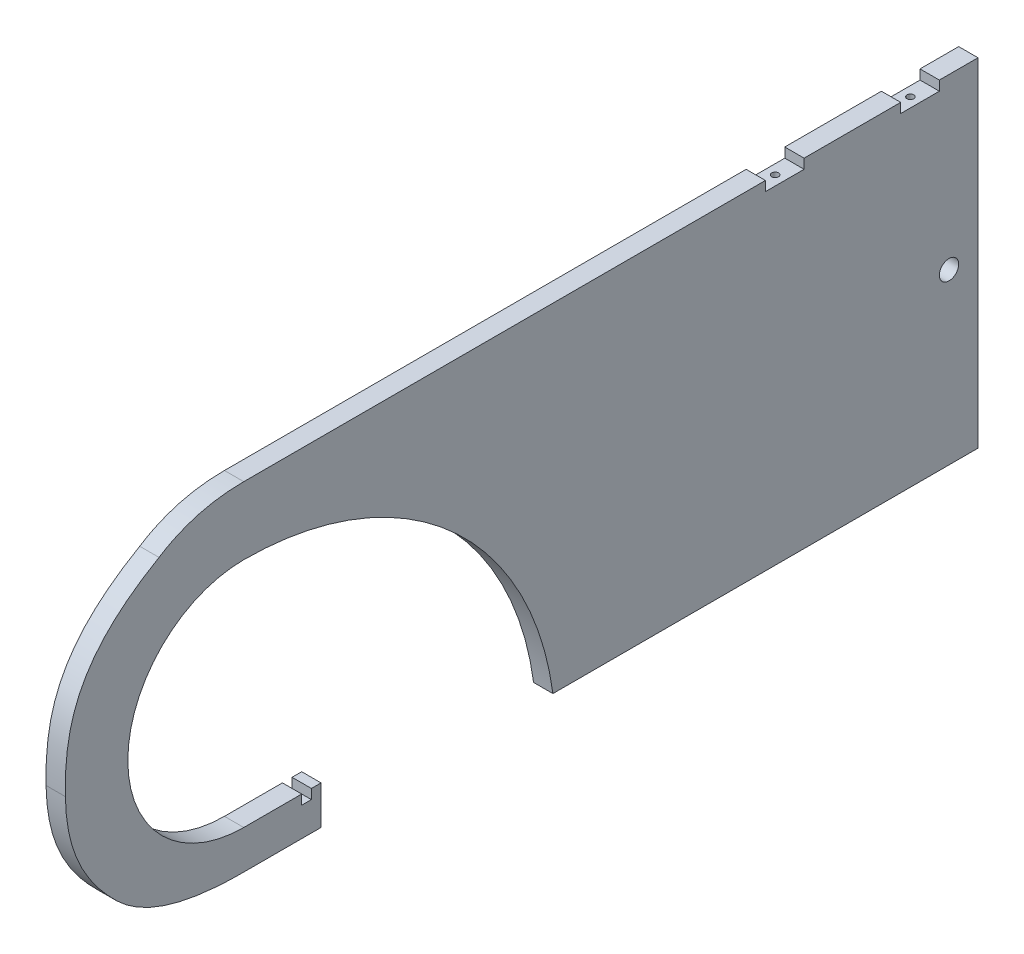
ISO-10303-21;
HEADER;
FILE_DESCRIPTION(('STEP AP214'),'2;1');
FILE_NAME('part.step','',(''),(''),'','','');
FILE_SCHEMA(('AUTOMOTIVE_DESIGN { 1 0 10303 214 1 1 1 1 }'));
ENDSEC;
DATA;
#1=APPLICATION_CONTEXT('core data for automotive mechanical design processes');
#2=APPLICATION_PROTOCOL_DEFINITION('international standard','automotive_design',2000,#1);
#3=PRODUCT_CONTEXT('',#1,'mechanical');
#4=PRODUCT('Part','Part','',(#3));
#5=PRODUCT_RELATED_PRODUCT_CATEGORY('part','',(#4));
#6=PRODUCT_DEFINITION_FORMATION('','',#4);
#7=PRODUCT_DEFINITION_CONTEXT('part definition',#1,'design');
#8=PRODUCT_DEFINITION('design','',#6,#7);
#9=PRODUCT_DEFINITION_SHAPE('','',#8);
#10=(LENGTH_UNIT() NAMED_UNIT(*) SI_UNIT(.MILLI.,.METRE.));
#11=(NAMED_UNIT(*) PLANE_ANGLE_UNIT() SI_UNIT($,.RADIAN.));
#12=(NAMED_UNIT(*) SI_UNIT($,.STERADIAN.) SOLID_ANGLE_UNIT());
#13=UNCERTAINTY_MEASURE_WITH_UNIT(LENGTH_MEASURE(1.E-05),#10,'distance_accuracy_value','');
#14=(GEOMETRIC_REPRESENTATION_CONTEXT(3) GLOBAL_UNCERTAINTY_ASSIGNED_CONTEXT((#13)) GLOBAL_UNIT_ASSIGNED_CONTEXT((#10,
#11,#12)) REPRESENTATION_CONTEXT('',''));
#15=CARTESIAN_POINT('',(0.,0.,0.));
#16=DIRECTION('',(0.,0.,1.));
#17=DIRECTION('',(1.,0.,0.));
#18=AXIS2_PLACEMENT_3D('',#15,#16,#17);
#19=CARTESIAN_POINT('',(3.175,-64.4071428571429,0.));
#20=DIRECTION('',(-1.,0.,0.));
#21=DIRECTION('',(0.,0.,1.));
#22=AXIS2_PLACEMENT_3D('',#19,#20,#21);
#23=PLANE('',#22);
#24=CARTESIAN_POINT('',(3.175,-64.4071428571429,0.));
#25=DIRECTION('',(-1.,0.,0.));
#26=DIRECTION('',(0.,0.,1.));
#27=AXIS2_PLACEMENT_3D('',#24,#25,#26);
#28=CIRCLE('',#27,102.507142857143);
#29=CARTESIAN_POINT('',(3.175,38.1,0.));
#30=VERTEX_POINT('',#29);
#31=CARTESIAN_POINT('',(3.175,-50.8,-101.6));
#32=VERTEX_POINT('',#31);
#33=EDGE_CURVE('E304',#30,#32,#28,.T.);
#34=ORIENTED_EDGE('',*,*,#33,.T.);
#35=DIRECTION('',(0.,0.,-1.));
#36=VECTOR('',#35,1.);
#37=CARTESIAN_POINT('',(3.175,-50.8,-241.3));
#38=LINE('',#37,#36);
#39=CARTESIAN_POINT('',(3.175,-50.8,-241.3));
#40=VERTEX_POINT('',#39);
#41=EDGE_CURVE('E150',#32,#40,#38,.T.);
#42=ORIENTED_EDGE('',*,*,#41,.T.);
#43=DIRECTION('',(0.,1.,0.));
#44=VECTOR('',#43,1.);
#45=CARTESIAN_POINT('',(3.175,-50.8,-241.3));
#46=LINE('',#45,#44);
#47=CARTESIAN_POINT('',(3.175,60.325,-241.3));
#48=VERTEX_POINT('',#47);
#49=EDGE_CURVE('E367',#40,#48,#46,.T.);
#50=ORIENTED_EDGE('',*,*,#49,.T.);
#51=DIRECTION('',(0.,0.,1.));
#52=VECTOR('',#51,1.);
#53=CARTESIAN_POINT('',(3.175,60.325,-228.6));
#54=LINE('',#53,#52);
#55=CARTESIAN_POINT('',(3.175,60.325,-228.6));
#56=VERTEX_POINT('',#55);
#57=EDGE_CURVE('E386',#48,#56,#54,.T.);
#58=ORIENTED_EDGE('',*,*,#57,.T.);
#59=DIRECTION('',(0.,-1.,0.));
#60=VECTOR('',#59,1.);
#61=CARTESIAN_POINT('',(3.175,57.15,-228.6));
#62=LINE('',#61,#60);
#63=CARTESIAN_POINT('',(3.175,57.15,-228.6));
#64=VERTEX_POINT('',#63);
#65=EDGE_CURVE('E383',#56,#64,#62,.T.);
#66=ORIENTED_EDGE('',*,*,#65,.T.);
#67=DIRECTION('',(0.,0.,1.));
#68=VECTOR('',#67,1.);
#69=CARTESIAN_POINT('',(3.175,57.15,-215.9));
#70=LINE('',#69,#68);
#71=CARTESIAN_POINT('',(3.175,57.15,-215.9));
#72=VERTEX_POINT('',#71);
#73=EDGE_CURVE('E385',#64,#72,#70,.T.);
#74=ORIENTED_EDGE('',*,*,#73,.T.);
#75=DIRECTION('',(0.,1.,0.));
#76=VECTOR('',#75,1.);
#77=CARTESIAN_POINT('',(3.175,60.325,-215.9));
#78=LINE('',#77,#76);
#79=CARTESIAN_POINT('',(3.175,60.325,-215.9));
#80=VERTEX_POINT('',#79);
#81=EDGE_CURVE('E388',#72,#80,#78,.T.);
#82=ORIENTED_EDGE('',*,*,#81,.T.);
#83=DIRECTION('',(0.,0.,1.));
#84=VECTOR('',#83,1.);
#85=CARTESIAN_POINT('',(3.175,60.325,-184.15));
#86=LINE('',#85,#84);
#87=CARTESIAN_POINT('',(3.175,60.325,-184.15));
#88=VERTEX_POINT('',#87);
#89=EDGE_CURVE('E394',#80,#88,#86,.T.);
#90=ORIENTED_EDGE('',*,*,#89,.T.);
#91=DIRECTION('',(0.,-1.,0.));
#92=VECTOR('',#91,1.);
#93=CARTESIAN_POINT('',(3.175,57.15,-184.15));
#94=LINE('',#93,#92);
#95=CARTESIAN_POINT('',(3.175,57.15,-184.15));
#96=VERTEX_POINT('',#95);
#97=EDGE_CURVE('E396',#88,#96,#94,.T.);
#98=ORIENTED_EDGE('',*,*,#97,.T.);
#99=DIRECTION('',(0.,0.,1.));
#100=VECTOR('',#99,1.);
#101=CARTESIAN_POINT('',(3.175,57.15,-184.15));
#102=LINE('',#101,#100);
#103=CARTESIAN_POINT('',(3.175,57.15,-171.45));
#104=VERTEX_POINT('',#103);
#105=EDGE_CURVE('E398',#96,#104,#102,.T.);
#106=ORIENTED_EDGE('',*,*,#105,.T.);
#107=DIRECTION('',(0.,1.,0.));
#108=VECTOR('',#107,1.);
#109=CARTESIAN_POINT('',(3.175,60.325,-171.45));
#110=LINE('',#109,#108);
#111=CARTESIAN_POINT('',(3.175,60.325,-171.45));
#112=VERTEX_POINT('',#111);
#113=EDGE_CURVE('E400',#104,#112,#110,.T.);
#114=ORIENTED_EDGE('',*,*,#113,.T.);
#115=DIRECTION('',(0.,0.,1.));
#116=VECTOR('',#115,1.);
#117=CARTESIAN_POINT('',(3.175,60.325,0.));
#118=LINE('',#117,#116);
#119=CARTESIAN_POINT('',(3.175,60.325,-1.17022265841842E-13));
#120=VERTEX_POINT('',#119);
#121=EDGE_CURVE('E402',#112,#120,#118,.T.);
#122=ORIENTED_EDGE('',*,*,#121,.T.);
#123=CARTESIAN_POINT('',(3.175,60.325,-1.17022265841842E-13));
#124=CARTESIAN_POINT('',(3.175,60.3278152788834,15.9703464496777));
#125=CARTESIAN_POINT('',(3.175,52.685548300019,27.8409064385983));
#126=B_SPLINE_CURVE_WITH_KNOTS('',2,(#123,#124,#125),.UNSPECIFIED.,.F.,.F.,(3,3),
(0.821555454210401,1.),.UNSPECIFIED.);
#127=CARTESIAN_POINT('',(3.175,52.685548300019,27.8409064385983));
#128=VERTEX_POINT('',#127);
#129=EDGE_CURVE('E404',#120,#128,#126,.T.);
#130=ORIENTED_EDGE('',*,*,#129,.T.);
#131=CARTESIAN_POINT('',(3.175,52.685548300019,27.8409064385983));
#132=CARTESIAN_POINT('',(3.175,37.0439477651412,54.9317583213997));
#133=CARTESIAN_POINT('',(3.175,19.7851162540507,58.9953428492264));
#134=CARTESIAN_POINT('',(3.175,0.,58.6251256892965));
#135=B_SPLINE_CURVE_WITH_KNOTS('',3,(#131,#132,#133,#134),.UNSPECIFIED.,.F.,.F.,(4,4),
(0.494452285004822,0.821555454210401),.UNSPECIFIED.);
#136=CARTESIAN_POINT('',(3.175,0.,58.6251256892965));
#137=VERTEX_POINT('',#136);
#138=EDGE_CURVE('E409',#128,#137,#135,.T.);
#139=ORIENTED_EDGE('',*,*,#138,.T.);
#140=CARTESIAN_POINT('',(3.175,0.,58.6251256892965));
#141=CARTESIAN_POINT('',(3.175,-16.1262516563846,58.3233728458013));
#142=CARTESIAN_POINT('',(3.175,-27.3608867865917,52.7073014739476));
#143=CARTESIAN_POINT('',(3.175,-38.1,41.7521995668224));
#144=B_SPLINE_CURVE_WITH_KNOTS('',3,(#140,#141,#142,#143),.UNSPECIFIED.,.F.,.F.,(4,4),
(0.219145000422326,0.494452285004822),.UNSPECIFIED.);
#145=CARTESIAN_POINT('',(3.175,-38.1,41.7521995668224));
#146=VERTEX_POINT('',#145);
#147=EDGE_CURVE('E512',#137,#146,#144,.T.);
#148=ORIENTED_EDGE('',*,*,#147,.T.);
#149=CARTESIAN_POINT('',(3.175,-38.1,41.7521995668224));
#150=CARTESIAN_POINT('',(3.175,-50.9225246923086,28.6717839012641));
#151=CARTESIAN_POINT('',(3.175,-50.8,0.));
#152=B_SPLINE_CURVE_WITH_KNOTS('',2,(#149,#150,#151),.UNSPECIFIED.,.F.,.F.,(3,3),(0.,
0.219145000422326),.UNSPECIFIED.);
#153=CARTESIAN_POINT('',(3.175,-50.8,0.));
#154=VERTEX_POINT('',#153);
#155=EDGE_CURVE('E506',#146,#154,#152,.T.);
#156=ORIENTED_EDGE('',*,*,#155,.T.);
#157=DIRECTION('',(0.,0.,-1.));
#158=VECTOR('',#157,1.);
#159=CARTESIAN_POINT('',(3.175,-50.8,0.));
#160=LINE('',#159,#158);
#161=CARTESIAN_POINT('',(3.175,-50.8,-25.4));
#162=VERTEX_POINT('',#161);
#163=EDGE_CURVE('E511',#154,#162,#160,.T.);
#164=ORIENTED_EDGE('',*,*,#163,.T.);
#165=DIRECTION('',(0.,1.,0.));
#166=VECTOR('',#165,1.);
#167=CARTESIAN_POINT('',(3.175,-50.8,-25.4));
#168=LINE('',#167,#166);
#169=CARTESIAN_POINT('',(3.175,-38.1,-25.4));
#170=VERTEX_POINT('',#169);
#171=EDGE_CURVE('E520',#162,#170,#168,.T.);
#172=ORIENTED_EDGE('',*,*,#171,.T.);
#173=DIRECTION('',(0.,0.,1.));
#174=VECTOR('',#173,1.);
#175=CARTESIAN_POINT('',(3.175,-38.1,-25.4));
#176=LINE('',#175,#174);
#177=CARTESIAN_POINT('',(3.175,-38.1,-22.225));
#178=VERTEX_POINT('',#177);
#179=EDGE_CURVE('E522',#170,#178,#176,.T.);
#180=ORIENTED_EDGE('',*,*,#179,.T.);
#181=DIRECTION('',(0.,-1.,0.));
#182=VECTOR('',#181,1.);
#183=CARTESIAN_POINT('',(3.175,-38.1,-22.225));
#184=LINE('',#183,#182);
#185=CARTESIAN_POINT('',(3.175,-41.275,-22.225));
#186=VERTEX_POINT('',#185);
#187=EDGE_CURVE('E524',#178,#186,#184,.T.);
#188=ORIENTED_EDGE('',*,*,#187,.T.);
#189=DIRECTION('',(0.,0.,1.));
#190=VECTOR('',#189,1.);
#191=CARTESIAN_POINT('',(3.175,-41.275,-22.225));
#192=LINE('',#191,#190);
#193=CARTESIAN_POINT('',(3.175,-41.275,-19.05));
#194=VERTEX_POINT('',#193);
#195=EDGE_CURVE('E219',#186,#194,#192,.T.);
#196=ORIENTED_EDGE('',*,*,#195,.T.);
#197=DIRECTION('',(0.,1.,0.));
#198=VECTOR('',#197,1.);
#199=CARTESIAN_POINT('',(3.175,-41.275,-19.05));
#200=LINE('',#199,#198);
#201=CARTESIAN_POINT('',(3.175,-38.1,-19.05));
#202=VERTEX_POINT('',#201);
#203=EDGE_CURVE('E213',#194,#202,#200,.T.);
#204=ORIENTED_EDGE('',*,*,#203,.T.);
#205=DIRECTION('',(0.,0.,1.));
#206=VECTOR('',#205,1.);
#207=CARTESIAN_POINT('',(3.175,-38.1,-19.05));
#208=LINE('',#207,#206);
#209=CARTESIAN_POINT('',(3.175,-38.1,0.));
#210=VERTEX_POINT('',#209);
#211=EDGE_CURVE('E217',#202,#210,#208,.T.);
#212=ORIENTED_EDGE('',*,*,#211,.T.);
#213=CARTESIAN_POINT('',(3.175,0.,0.));
#214=DIRECTION('',(-1.,0.,0.));
#215=DIRECTION('',(0.,0.,-1.));
#216=AXIS2_PLACEMENT_3D('',#213,#214,#215);
#217=CIRCLE('',#216,38.1);
#218=EDGE_CURVE('E58',#210,#30,#217,.T.);
#219=ORIENTED_EDGE('',*,*,#218,.T.);
#220=EDGE_LOOP('',(#34,#42,#50,#58,#66,#74,#82,#90,#98,#106,#114,#122,#130,#139,#148,#156,#164,
#172,#180,#188,#196,#204,#212,#219));
#221=FACE_BOUND('',#220,.T.);
#222=CARTESIAN_POINT('',(3.175,4.76250000000001,-231.775));
#223=DIRECTION('',(1.,0.,0.));
#224=DIRECTION('',(0.,0.,-1.));
#225=AXIS2_PLACEMENT_3D('',#222,#223,#224);
#226=CIRCLE('',#225,3.175);
#227=CARTESIAN_POINT('',(3.175,4.76250000000001,-234.95));
#228=VERTEX_POINT('',#227);
#229=EDGE_CURVE('E241',#228,#228,#226,.T.);
#230=ORIENTED_EDGE('',*,*,#229,.F.);
#231=EDGE_LOOP('',(#230));
#232=FACE_BOUND('',#231,.T.);
#233=ADVANCED_FACE('F41',(#221,#232),#23,.F.);
#234=CARTESIAN_POINT('',(-3.175,-64.4071428571429,0.));
#235=DIRECTION('',(-1.,0.,0.));
#236=DIRECTION('',(0.,0.,1.));
#237=AXIS2_PLACEMENT_3D('',#234,#235,#236);
#238=PLANE('',#237);
#239=CARTESIAN_POINT('',(-3.175,-64.4071428571429,0.));
#240=DIRECTION('',(-1.,0.,0.));
#241=DIRECTION('',(0.,0.,1.));
#242=AXIS2_PLACEMENT_3D('',#239,#240,#241);
#243=CIRCLE('',#242,102.507142857143);
#244=CARTESIAN_POINT('',(-3.175,38.1,0.));
#245=VERTEX_POINT('',#244);
#246=CARTESIAN_POINT('',(-3.175,-50.8,-101.6));
#247=VERTEX_POINT('',#246);
#248=EDGE_CURVE('E237',#245,#247,#243,.T.);
#249=ORIENTED_EDGE('',*,*,#248,.F.);
#250=CARTESIAN_POINT('',(-3.175,0.,0.));
#251=DIRECTION('',(-1.,0.,0.));
#252=DIRECTION('',(0.,0.,-1.));
#253=AXIS2_PLACEMENT_3D('',#250,#251,#252);
#254=CIRCLE('',#253,38.1);
#255=CARTESIAN_POINT('',(-3.175,-38.1,0.));
#256=VERTEX_POINT('',#255);
#257=EDGE_CURVE('E142',#256,#245,#254,.T.);
#258=ORIENTED_EDGE('',*,*,#257,.F.);
#259=DIRECTION('',(0.,0.,1.));
#260=VECTOR('',#259,1.);
#261=CARTESIAN_POINT('',(-3.175,-38.1,-19.05));
#262=LINE('',#261,#260);
#263=CARTESIAN_POINT('',(-3.175,-38.1,-19.05));
#264=VERTEX_POINT('',#263);
#265=EDGE_CURVE('E136',#264,#256,#262,.T.);
#266=ORIENTED_EDGE('',*,*,#265,.F.);
#267=DIRECTION('',(0.,1.,0.));
#268=VECTOR('',#267,1.);
#269=CARTESIAN_POINT('',(-3.175,-41.275,-19.05));
#270=LINE('',#269,#268);
#271=CARTESIAN_POINT('',(-3.175,-41.275,-19.05));
#272=VERTEX_POINT('',#271);
#273=EDGE_CURVE('E227',#272,#264,#270,.T.);
#274=ORIENTED_EDGE('',*,*,#273,.F.);
#275=DIRECTION('',(0.,0.,1.));
#276=VECTOR('',#275,1.);
#277=CARTESIAN_POINT('',(-3.175,-41.275,-22.225));
#278=LINE('',#277,#276);
#279=CARTESIAN_POINT('',(-3.175,-41.275,-22.225));
#280=VERTEX_POINT('',#279);
#281=EDGE_CURVE('E299',#280,#272,#278,.T.);
#282=ORIENTED_EDGE('',*,*,#281,.F.);
#283=DIRECTION('',(0.,-1.,0.));
#284=VECTOR('',#283,1.);
#285=CARTESIAN_POINT('',(-3.175,-38.1,-22.225));
#286=LINE('',#285,#284);
#287=CARTESIAN_POINT('',(-3.175,-38.1,-22.225));
#288=VERTEX_POINT('',#287);
#289=EDGE_CURVE('E297',#288,#280,#286,.T.);
#290=ORIENTED_EDGE('',*,*,#289,.F.);
#291=DIRECTION('',(0.,0.,1.));
#292=VECTOR('',#291,1.);
#293=CARTESIAN_POINT('',(-3.175,-38.1,-25.4));
#294=LINE('',#293,#292);
#295=CARTESIAN_POINT('',(-3.175,-38.1,-25.4));
#296=VERTEX_POINT('',#295);
#297=EDGE_CURVE('E295',#296,#288,#294,.T.);
#298=ORIENTED_EDGE('',*,*,#297,.F.);
#299=DIRECTION('',(0.,1.,0.));
#300=VECTOR('',#299,1.);
#301=CARTESIAN_POINT('',(-3.175,-50.8,-25.4));
#302=LINE('',#301,#300);
#303=CARTESIAN_POINT('',(-3.175,-50.8,-25.4));
#304=VERTEX_POINT('',#303);
#305=EDGE_CURVE('E293',#304,#296,#302,.T.);
#306=ORIENTED_EDGE('',*,*,#305,.F.);
#307=DIRECTION('',(0.,0.,-1.));
#308=VECTOR('',#307,1.);
#309=CARTESIAN_POINT('',(-3.175,-50.8,0.));
#310=LINE('',#309,#308);
#311=CARTESIAN_POINT('',(-3.175,-50.8,0.));
#312=VERTEX_POINT('',#311);
#313=EDGE_CURVE('E288',#312,#304,#310,.T.);
#314=ORIENTED_EDGE('',*,*,#313,.F.);
#315=CARTESIAN_POINT('',(-3.175,-38.1,41.7521995668224));
#316=CARTESIAN_POINT('',(-3.175,-50.9225246923086,28.6717839012641));
#317=CARTESIAN_POINT('',(-3.175,-50.8,0.));
#318=B_SPLINE_CURVE_WITH_KNOTS('',2,(#315,#316,#317),.UNSPECIFIED.,.F.,.F.,(3,3),(0.,
0.219145000422326),.UNSPECIFIED.);
#319=CARTESIAN_POINT('',(-3.175,-38.1,41.7521995668224));
#320=VERTEX_POINT('',#319);
#321=EDGE_CURVE('E281',#320,#312,#318,.T.);
#322=ORIENTED_EDGE('',*,*,#321,.F.);
#323=CARTESIAN_POINT('',(-3.175,0.,58.6251256892965));
#324=CARTESIAN_POINT('',(-3.175,-16.1262516563846,58.3233728458013));
#325=CARTESIAN_POINT('',(-3.175,-27.3608867865917,52.7073014739476));
#326=CARTESIAN_POINT('',(-3.175,-38.1,41.7521995668224));
#327=B_SPLINE_CURVE_WITH_KNOTS('',3,(#323,#324,#325,#326),.UNSPECIFIED.,.F.,.F.,(4,4),
(0.219145000422326,0.494452285004822),.UNSPECIFIED.);
#328=CARTESIAN_POINT('',(-3.175,0.,58.6251256892965));
#329=VERTEX_POINT('',#328);
#330=EDGE_CURVE('E274',#329,#320,#327,.T.);
#331=ORIENTED_EDGE('',*,*,#330,.F.);
#332=CARTESIAN_POINT('',(-3.175,52.685548300019,27.8409064385983));
#333=CARTESIAN_POINT('',(-3.175,37.0439477651412,54.9317583213997));
#334=CARTESIAN_POINT('',(-3.175,19.7851162540507,58.9953428492264));
#335=CARTESIAN_POINT('',(-3.175,0.,58.6251256892965));
#336=B_SPLINE_CURVE_WITH_KNOTS('',3,(#332,#333,#334,#335),.UNSPECIFIED.,.F.,.F.,(4,4),
(0.494452285004822,0.821555454210401),.UNSPECIFIED.);
#337=CARTESIAN_POINT('',(-3.175,52.685548300019,27.8409064385983));
#338=VERTEX_POINT('',#337);
#339=EDGE_CURVE('E267',#338,#329,#336,.T.);
#340=ORIENTED_EDGE('',*,*,#339,.F.);
#341=CARTESIAN_POINT('',(-3.175,60.325,-1.17022265841842E-13));
#342=CARTESIAN_POINT('',(-3.175,60.3278152788834,15.9703464496777));
#343=CARTESIAN_POINT('',(-3.175,52.685548300019,27.8409064385983));
#344=B_SPLINE_CURVE_WITH_KNOTS('',2,(#341,#342,#343),.UNSPECIFIED.,.F.,.F.,(3,3),
(0.821555454210401,1.),.UNSPECIFIED.);
#345=CARTESIAN_POINT('',(-3.175,60.325,-1.17022265841842E-13));
#346=VERTEX_POINT('',#345);
#347=EDGE_CURVE('E263',#346,#338,#344,.T.);
#348=ORIENTED_EDGE('',*,*,#347,.F.);
#349=DIRECTION('',(0.,0.,1.));
#350=VECTOR('',#349,1.);
#351=CARTESIAN_POINT('',(-3.175,60.325,0.));
#352=LINE('',#351,#350);
#353=CARTESIAN_POINT('',(-3.175,60.325,-171.45));
#354=VERTEX_POINT('',#353);
#355=EDGE_CURVE('E261',#354,#346,#352,.T.);
#356=ORIENTED_EDGE('',*,*,#355,.F.);
#357=DIRECTION('',(0.,1.,0.));
#358=VECTOR('',#357,1.);
#359=CARTESIAN_POINT('',(-3.175,60.325,-171.45));
#360=LINE('',#359,#358);
#361=CARTESIAN_POINT('',(-3.175,57.15,-171.45));
#362=VERTEX_POINT('',#361);
#363=EDGE_CURVE('E259',#362,#354,#360,.T.);
#364=ORIENTED_EDGE('',*,*,#363,.F.);
#365=DIRECTION('',(0.,0.,1.));
#366=VECTOR('',#365,1.);
#367=CARTESIAN_POINT('',(-3.175,57.15,-184.15));
#368=LINE('',#367,#366);
#369=CARTESIAN_POINT('',(-3.175,57.15,-184.15));
#370=VERTEX_POINT('',#369);
#371=EDGE_CURVE('E257',#370,#362,#368,.T.);
#372=ORIENTED_EDGE('',*,*,#371,.F.);
#373=DIRECTION('',(0.,-1.,0.));
#374=VECTOR('',#373,1.);
#375=CARTESIAN_POINT('',(-3.175,57.15,-184.15));
#376=LINE('',#375,#374);
#377=CARTESIAN_POINT('',(-3.175,60.325,-184.15));
#378=VERTEX_POINT('',#377);
#379=EDGE_CURVE('E255',#378,#370,#376,.T.);
#380=ORIENTED_EDGE('',*,*,#379,.F.);
#381=DIRECTION('',(0.,0.,1.));
#382=VECTOR('',#381,1.);
#383=CARTESIAN_POINT('',(-3.175,60.325,-184.15));
#384=LINE('',#383,#382);
#385=CARTESIAN_POINT('',(-3.175,60.325,-215.9));
#386=VERTEX_POINT('',#385);
#387=EDGE_CURVE('E253',#386,#378,#384,.T.);
#388=ORIENTED_EDGE('',*,*,#387,.F.);
#389=DIRECTION('',(0.,1.,0.));
#390=VECTOR('',#389,1.);
#391=CARTESIAN_POINT('',(-3.175,60.325,-215.9));
#392=LINE('',#391,#390);
#393=CARTESIAN_POINT('',(-3.175,57.15,-215.9));
#394=VERTEX_POINT('',#393);
#395=EDGE_CURVE('E251',#394,#386,#392,.T.);
#396=ORIENTED_EDGE('',*,*,#395,.F.);
#397=DIRECTION('',(0.,0.,1.));
#398=VECTOR('',#397,1.);
#399=CARTESIAN_POINT('',(-3.175,57.15,-215.9));
#400=LINE('',#399,#398);
#401=CARTESIAN_POINT('',(-3.175,57.15,-228.6));
#402=VERTEX_POINT('',#401);
#403=EDGE_CURVE('E249',#402,#394,#400,.T.);
#404=ORIENTED_EDGE('',*,*,#403,.F.);
#405=DIRECTION('',(0.,-1.,0.));
#406=VECTOR('',#405,1.);
#407=CARTESIAN_POINT('',(-3.175,57.15,-228.6));
#408=LINE('',#407,#406);
#409=CARTESIAN_POINT('',(-3.175,60.325,-228.6));
#410=VERTEX_POINT('',#409);
#411=EDGE_CURVE('E247',#410,#402,#408,.T.);
#412=ORIENTED_EDGE('',*,*,#411,.F.);
#413=DIRECTION('',(0.,0.,1.));
#414=VECTOR('',#413,1.);
#415=CARTESIAN_POINT('',(-3.175,60.325,-228.6));
#416=LINE('',#415,#414);
#417=CARTESIAN_POINT('',(-3.175,60.325,-241.3));
#418=VERTEX_POINT('',#417);
#419=EDGE_CURVE('E245',#418,#410,#416,.T.);
#420=ORIENTED_EDGE('',*,*,#419,.F.);
#421=DIRECTION('',(0.,1.,0.));
#422=VECTOR('',#421,1.);
#423=CARTESIAN_POINT('',(-3.175,-50.8,-241.3));
#424=LINE('',#423,#422);
#425=CARTESIAN_POINT('',(-3.175,-50.8,-241.3));
#426=VERTEX_POINT('',#425);
#427=EDGE_CURVE('E243',#426,#418,#424,.T.);
#428=ORIENTED_EDGE('',*,*,#427,.F.);
#429=DIRECTION('',(0.,0.,-1.));
#430=VECTOR('',#429,1.);
#431=CARTESIAN_POINT('',(-3.175,-50.8,-241.3));
#432=LINE('',#431,#430);
#433=EDGE_CURVE('E240',#247,#426,#432,.T.);
#434=ORIENTED_EDGE('',*,*,#433,.F.);
#435=EDGE_LOOP('',(#249,#258,#266,#274,#282,#290,#298,#306,#314,#322,#331,#340,#348,#356,#364,
#372,#380,#388,#396,#404,#412,#420,#428,#434));
#436=FACE_BOUND('',#435,.T.);
#437=CARTESIAN_POINT('',(-3.175,4.76250000000001,-231.775));
#438=DIRECTION('',(1.,0.,0.));
#439=DIRECTION('',(0.,0.,-1.));
#440=AXIS2_PLACEMENT_3D('',#437,#438,#439);
#441=CIRCLE('',#440,3.175);
#442=CARTESIAN_POINT('',(-3.175,4.76250000000001,-234.95));
#443=VERTEX_POINT('',#442);
#444=EDGE_CURVE('E536',#443,#443,#441,.T.);
#445=ORIENTED_EDGE('',*,*,#444,.T.);
#446=EDGE_LOOP('',(#445));
#447=FACE_BOUND('',#446,.T.);
#448=ADVANCED_FACE('F371',(#436,#447),#238,.T.);
#449=CARTESIAN_POINT('',(3.175,-64.4071428571429,0.));
#450=DIRECTION('',(-1.,0.,0.));
#451=DIRECTION('',(0.,0.,1.));
#452=AXIS2_PLACEMENT_3D('',#449,#450,#451);
#453=CYLINDRICAL_SURFACE('',#452,102.507142857143);
#454=ORIENTED_EDGE('',*,*,#248,.T.);
#455=DIRECTION('',(-1.,0.,0.));
#456=VECTOR('',#455,1.);
#457=CARTESIAN_POINT('',(3.175,-50.8,-101.6));
#458=LINE('',#457,#456);
#459=EDGE_CURVE('E11',#32,#247,#458,.T.);
#460=ORIENTED_EDGE('',*,*,#459,.F.);
#461=ORIENTED_EDGE('',*,*,#33,.F.);
#462=DIRECTION('',(-1.,0.,0.));
#463=VECTOR('',#462,1.);
#464=CARTESIAN_POINT('',(3.175,38.1,0.));
#465=LINE('',#464,#463);
#466=EDGE_CURVE('E233',#30,#245,#465,.T.);
#467=ORIENTED_EDGE('',*,*,#466,.T.);
#468=EDGE_LOOP('',(#454,#460,#461,#467));
#469=FACE_BOUND('',#468,.T.);
#470=ADVANCED_FACE('F43',(#469),#453,.F.);
#471=CARTESIAN_POINT('',(3.175,-50.8,-241.3));
#472=DIRECTION('',(0.,1.,0.));
#473=DIRECTION('',(0.,0.,1.));
#474=AXIS2_PLACEMENT_3D('',#471,#472,#473);
#475=PLANE('',#474);
#476=ORIENTED_EDGE('',*,*,#433,.T.);
#477=DIRECTION('',(-1.,0.,0.));
#478=VECTOR('',#477,1.);
#479=CARTESIAN_POINT('',(3.175,-50.8,-241.3));
#480=LINE('',#479,#478);
#481=EDGE_CURVE('E50',#40,#426,#480,.T.);
#482=ORIENTED_EDGE('',*,*,#481,.F.);
#483=ORIENTED_EDGE('',*,*,#41,.F.);
#484=ORIENTED_EDGE('',*,*,#459,.T.);
#485=EDGE_LOOP('',(#476,#482,#483,#484));
#486=FACE_BOUND('',#485,.T.);
#487=ADVANCED_FACE('F458',(#486),#475,.F.);
#488=CARTESIAN_POINT('',(3.175,-50.8,-241.3));
#489=DIRECTION('',(0.,0.,1.));
#490=DIRECTION('',(1.,0.,0.));
#491=AXIS2_PLACEMENT_3D('',#488,#489,#490);
#492=PLANE('',#491);
#493=ORIENTED_EDGE('',*,*,#427,.T.);
#494=DIRECTION('',(-1.,0.,0.));
#495=VECTOR('',#494,1.);
#496=CARTESIAN_POINT('',(3.175,60.325,-241.3));
#497=LINE('',#496,#495);
#498=EDGE_CURVE('E359',#48,#418,#497,.T.);
#499=ORIENTED_EDGE('',*,*,#498,.F.);
#500=ORIENTED_EDGE('',*,*,#49,.F.);
#501=ORIENTED_EDGE('',*,*,#481,.T.);
#502=EDGE_LOOP('',(#493,#499,#500,#501));
#503=FACE_BOUND('',#502,.T.);
#504=ADVANCED_FACE('F365',(#503),#492,.F.);
#505=CARTESIAN_POINT('',(3.175,60.325,-228.6));
#506=DIRECTION('',(0.,-1.,0.));
#507=DIRECTION('',(0.,0.,-1.));
#508=AXIS2_PLACEMENT_3D('',#505,#506,#507);
#509=PLANE('',#508);
#510=ORIENTED_EDGE('',*,*,#419,.T.);
#511=DIRECTION('',(-1.,0.,0.));
#512=VECTOR('',#511,1.);
#513=CARTESIAN_POINT('',(3.175,60.325,-228.6));
#514=LINE('',#513,#512);
#515=EDGE_CURVE('E356',#56,#410,#514,.T.);
#516=ORIENTED_EDGE('',*,*,#515,.F.);
#517=ORIENTED_EDGE('',*,*,#57,.F.);
#518=ORIENTED_EDGE('',*,*,#498,.T.);
#519=EDGE_LOOP('',(#510,#516,#517,#518));
#520=FACE_BOUND('',#519,.T.);
#521=ADVANCED_FACE('F377',(#520),#509,.F.);
#522=CARTESIAN_POINT('',(3.175,57.15,-228.6));
#523=DIRECTION('',(0.,0.,-1.));
#524=DIRECTION('',(-1.,0.,0.));
#525=AXIS2_PLACEMENT_3D('',#522,#523,#524);
#526=PLANE('',#525);
#527=ORIENTED_EDGE('',*,*,#411,.T.);
#528=DIRECTION('',(-1.,0.,0.));
#529=VECTOR('',#528,1.);
#530=CARTESIAN_POINT('',(3.175,57.15,-228.6));
#531=LINE('',#530,#529);
#532=EDGE_CURVE('E353',#64,#402,#531,.T.);
#533=ORIENTED_EDGE('',*,*,#532,.F.);
#534=ORIENTED_EDGE('',*,*,#65,.F.);
#535=ORIENTED_EDGE('',*,*,#515,.T.);
#536=EDGE_LOOP('',(#527,#533,#534,#535));
#537=FACE_BOUND('',#536,.T.);
#538=ADVANCED_FACE('F381',(#537),#526,.F.);
#539=CARTESIAN_POINT('',(3.175,57.15,-215.9));
#540=DIRECTION('',(0.,-1.,0.));
#541=DIRECTION('',(0.,0.,-1.));
#542=AXIS2_PLACEMENT_3D('',#539,#540,#541);
#543=PLANE('',#542);
#544=CARTESIAN_POINT('',(0.,57.1500000000002,-222.25));
#545=DIRECTION('',(0.,1.,0.));
#546=DIRECTION('',(0.,0.,1.));
#547=AXIS2_PLACEMENT_3D('',#544,#545,#546);
#548=CIRCLE('',#547,1.13029999999999);
#549=CARTESIAN_POINT('',(0.,57.1500000000002,-221.1197));
#550=VERTEX_POINT('',#549);
#551=EDGE_CURVE('E550',#550,#550,#548,.T.);
#552=ORIENTED_EDGE('',*,*,#551,.F.);
#553=EDGE_LOOP('',(#552));
#554=FACE_BOUND('',#553,.T.);
#555=ORIENTED_EDGE('',*,*,#403,.T.);
#556=DIRECTION('',(-1.,0.,0.));
#557=VECTOR('',#556,1.);
#558=CARTESIAN_POINT('',(3.175,57.15,-215.9));
#559=LINE('',#558,#557);
#560=EDGE_CURVE('E350',#72,#394,#559,.T.);
#561=ORIENTED_EDGE('',*,*,#560,.F.);
#562=ORIENTED_EDGE('',*,*,#73,.F.);
#563=ORIENTED_EDGE('',*,*,#532,.T.);
#564=EDGE_LOOP('',(#555,#561,#562,#563));
#565=FACE_BOUND('',#564,.T.);
#566=ADVANCED_FACE('F448',(#554,#565),#543,.F.);
#567=CARTESIAN_POINT('',(3.175,60.325,-215.9));
#568=DIRECTION('',(0.,0.,1.));
#569=DIRECTION('',(1.,0.,0.));
#570=AXIS2_PLACEMENT_3D('',#567,#568,#569);
#571=PLANE('',#570);
#572=ORIENTED_EDGE('',*,*,#395,.T.);
#573=DIRECTION('',(-1.,0.,0.));
#574=VECTOR('',#573,1.);
#575=CARTESIAN_POINT('',(3.175,60.325,-215.9));
#576=LINE('',#575,#574);
#577=EDGE_CURVE('E347',#80,#386,#576,.T.);
#578=ORIENTED_EDGE('',*,*,#577,.F.);
#579=ORIENTED_EDGE('',*,*,#81,.F.);
#580=ORIENTED_EDGE('',*,*,#560,.T.);
#581=EDGE_LOOP('',(#572,#578,#579,#580));
#582=FACE_BOUND('',#581,.T.);
#583=ADVANCED_FACE('F444',(#582),#571,.F.);
#584=CARTESIAN_POINT('',(3.175,60.325,-184.15));
#585=DIRECTION('',(0.,-1.,0.));
#586=DIRECTION('',(0.,0.,-1.));
#587=AXIS2_PLACEMENT_3D('',#584,#585,#586);
#588=PLANE('',#587);
#589=ORIENTED_EDGE('',*,*,#387,.T.);
#590=DIRECTION('',(-1.,0.,0.));
#591=VECTOR('',#590,1.);
#592=CARTESIAN_POINT('',(3.175,60.325,-184.15));
#593=LINE('',#592,#591);
#594=EDGE_CURVE('E344',#88,#378,#593,.T.);
#595=ORIENTED_EDGE('',*,*,#594,.F.);
#596=ORIENTED_EDGE('',*,*,#89,.F.);
#597=ORIENTED_EDGE('',*,*,#577,.T.);
#598=EDGE_LOOP('',(#589,#595,#596,#597));
#599=FACE_BOUND('',#598,.T.);
#600=ADVANCED_FACE('F440',(#599),#588,.F.);
#601=CARTESIAN_POINT('',(3.175,57.15,-184.15));
#602=DIRECTION('',(0.,0.,-1.));
#603=DIRECTION('',(-1.,0.,0.));
#604=AXIS2_PLACEMENT_3D('',#601,#602,#603);
#605=PLANE('',#604);
#606=ORIENTED_EDGE('',*,*,#379,.T.);
#607=DIRECTION('',(-1.,0.,0.));
#608=VECTOR('',#607,1.);
#609=CARTESIAN_POINT('',(3.175,57.15,-184.15));
#610=LINE('',#609,#608);
#611=EDGE_CURVE('E341',#96,#370,#610,.T.);
#612=ORIENTED_EDGE('',*,*,#611,.F.);
#613=ORIENTED_EDGE('',*,*,#97,.F.);
#614=ORIENTED_EDGE('',*,*,#594,.T.);
#615=EDGE_LOOP('',(#606,#612,#613,#614));
#616=FACE_BOUND('',#615,.T.);
#617=ADVANCED_FACE('F436',(#616),#605,.F.);
#618=CARTESIAN_POINT('',(3.175,57.15,-184.15));
#619=DIRECTION('',(0.,-1.,0.));
#620=DIRECTION('',(0.,0.,-1.));
#621=AXIS2_PLACEMENT_3D('',#618,#619,#620);
#622=PLANE('',#621);
#623=CARTESIAN_POINT('',(0.,57.1500000000002,-177.8));
#624=DIRECTION('',(0.,1.,0.));
#625=DIRECTION('',(0.,0.,1.));
#626=AXIS2_PLACEMENT_3D('',#623,#624,#625);
#627=CIRCLE('',#626,1.13029999999999);
#628=CARTESIAN_POINT('',(0.,57.1500000000002,-176.6697));
#629=VERTEX_POINT('',#628);
#630=EDGE_CURVE('E544',#629,#629,#627,.T.);
#631=ORIENTED_EDGE('',*,*,#630,.F.);
#632=EDGE_LOOP('',(#631));
#633=FACE_BOUND('',#632,.T.);
#634=ORIENTED_EDGE('',*,*,#371,.T.);
#635=DIRECTION('',(-1.,0.,0.));
#636=VECTOR('',#635,1.);
#637=CARTESIAN_POINT('',(3.175,57.15,-171.45));
#638=LINE('',#637,#636);
#639=EDGE_CURVE('E338',#104,#362,#638,.T.);
#640=ORIENTED_EDGE('',*,*,#639,.F.);
#641=ORIENTED_EDGE('',*,*,#105,.F.);
#642=ORIENTED_EDGE('',*,*,#611,.T.);
#643=EDGE_LOOP('',(#634,#640,#641,#642));
#644=FACE_BOUND('',#643,.T.);
#645=ADVANCED_FACE('F432',(#633,#644),#622,.F.);
#646=CARTESIAN_POINT('',(3.175,60.325,-171.45));
#647=DIRECTION('',(0.,0.,1.));
#648=DIRECTION('',(0.,-1.,0.));
#649=AXIS2_PLACEMENT_3D('',#646,#647,#648);
#650=PLANE('',#649);
#651=ORIENTED_EDGE('',*,*,#363,.T.);
#652=DIRECTION('',(-1.,0.,0.));
#653=VECTOR('',#652,1.);
#654=CARTESIAN_POINT('',(3.175,60.325,-171.45));
#655=LINE('',#654,#653);
#656=EDGE_CURVE('E335',#112,#354,#655,.T.);
#657=ORIENTED_EDGE('',*,*,#656,.F.);
#658=ORIENTED_EDGE('',*,*,#113,.F.);
#659=ORIENTED_EDGE('',*,*,#639,.T.);
#660=EDGE_LOOP('',(#651,#657,#658,#659));
#661=FACE_BOUND('',#660,.T.);
#662=ADVANCED_FACE('F428',(#661),#650,.F.);
#663=CARTESIAN_POINT('',(3.175,60.325,0.));
#664=DIRECTION('',(0.,-1.,0.));
#665=DIRECTION('',(0.,0.,-1.));
#666=AXIS2_PLACEMENT_3D('',#663,#664,#665);
#667=PLANE('',#666);
#668=ORIENTED_EDGE('',*,*,#355,.T.);
#669=DIRECTION('',(-1.,0.,0.));
#670=VECTOR('',#669,1.);
#671=CARTESIAN_POINT('',(3.175,60.325,-1.17022265841842E-13));
#672=LINE('',#671,#670);
#673=EDGE_CURVE('E332',#120,#346,#672,.T.);
#674=ORIENTED_EDGE('',*,*,#673,.F.);
#675=ORIENTED_EDGE('',*,*,#121,.F.);
#676=ORIENTED_EDGE('',*,*,#656,.T.);
#677=EDGE_LOOP('',(#668,#674,#675,#676));
#678=FACE_BOUND('',#677,.T.);
#679=ADVANCED_FACE('F423',(#678),#667,.F.);
#680=DIRECTION('',(-1.,0.,0.));
#681=VECTOR('',#680,1.);
#682=SURFACE_OF_LINEAR_EXTRUSION('',#126,#681);
#683=ORIENTED_EDGE('',*,*,#347,.T.);
#684=DIRECTION('',(-1.,0.,0.));
#685=VECTOR('',#684,1.);
#686=CARTESIAN_POINT('',(3.175,52.685548300019,27.8409064385983));
#687=LINE('',#686,#685);
#688=EDGE_CURVE('E329',#128,#338,#687,.T.);
#689=ORIENTED_EDGE('',*,*,#688,.F.);
#690=ORIENTED_EDGE('',*,*,#129,.F.);
#691=ORIENTED_EDGE('',*,*,#673,.T.);
#692=EDGE_LOOP('',(#683,#689,#690,#691));
#693=FACE_BOUND('',#692,.T.);
#694=ADVANCED_FACE('F418',(#693),#682,.F.);
#695=DIRECTION('',(-1.,0.,0.));
#696=VECTOR('',#695,1.);
#697=SURFACE_OF_LINEAR_EXTRUSION('',#135,#696);
#698=ORIENTED_EDGE('',*,*,#339,.T.);
#699=DIRECTION('',(-1.,0.,0.));
#700=VECTOR('',#699,1.);
#701=CARTESIAN_POINT('',(3.175,0.,58.6251256892965));
#702=LINE('',#701,#700);
#703=EDGE_CURVE('E326',#137,#329,#702,.T.);
#704=ORIENTED_EDGE('',*,*,#703,.F.);
#705=ORIENTED_EDGE('',*,*,#138,.F.);
#706=ORIENTED_EDGE('',*,*,#688,.T.);
#707=EDGE_LOOP('',(#698,#704,#705,#706));
#708=FACE_BOUND('',#707,.T.);
#709=ADVANCED_FACE('F422',(#708),#697,.F.);
#710=DIRECTION('',(-1.,0.,0.));
#711=VECTOR('',#710,1.);
#712=SURFACE_OF_LINEAR_EXTRUSION('',#144,#711);
#713=ORIENTED_EDGE('',*,*,#330,.T.);
#714=DIRECTION('',(-1.,0.,0.));
#715=VECTOR('',#714,1.);
#716=CARTESIAN_POINT('',(3.175,-38.1,41.7521995668224));
#717=LINE('',#716,#715);
#718=EDGE_CURVE('E323',#146,#320,#717,.T.);
#719=ORIENTED_EDGE('',*,*,#718,.F.);
#720=ORIENTED_EDGE('',*,*,#147,.F.);
#721=ORIENTED_EDGE('',*,*,#703,.T.);
#722=EDGE_LOOP('',(#713,#719,#720,#721));
#723=FACE_BOUND('',#722,.T.);
#724=ADVANCED_FACE('F504',(#723),#712,.F.);
#725=DIRECTION('',(-1.,0.,0.));
#726=VECTOR('',#725,1.);
#727=SURFACE_OF_LINEAR_EXTRUSION('',#152,#726);
#728=ORIENTED_EDGE('',*,*,#321,.T.);
#729=DIRECTION('',(-1.,0.,0.));
#730=VECTOR('',#729,1.);
#731=CARTESIAN_POINT('',(3.175,-50.8,0.));
#732=LINE('',#731,#730);
#733=EDGE_CURVE('E320',#154,#312,#732,.T.);
#734=ORIENTED_EDGE('',*,*,#733,.F.);
#735=ORIENTED_EDGE('',*,*,#155,.F.);
#736=ORIENTED_EDGE('',*,*,#718,.T.);
#737=EDGE_LOOP('',(#728,#734,#735,#736));
#738=FACE_BOUND('',#737,.T.);
#739=ADVANCED_FACE('F500',(#738),#727,.F.);
#740=CARTESIAN_POINT('',(3.175,-50.8,0.));
#741=DIRECTION('',(0.,1.,0.));
#742=DIRECTION('',(0.,0.,1.));
#743=AXIS2_PLACEMENT_3D('',#740,#741,#742);
#744=PLANE('',#743);
#745=ORIENTED_EDGE('',*,*,#313,.T.);
#746=DIRECTION('',(-1.,0.,0.));
#747=VECTOR('',#746,1.);
#748=CARTESIAN_POINT('',(3.175,-50.8,-25.4));
#749=LINE('',#748,#747);
#750=EDGE_CURVE('E317',#162,#304,#749,.T.);
#751=ORIENTED_EDGE('',*,*,#750,.F.);
#752=ORIENTED_EDGE('',*,*,#163,.F.);
#753=ORIENTED_EDGE('',*,*,#733,.T.);
#754=EDGE_LOOP('',(#745,#751,#752,#753));
#755=FACE_BOUND('',#754,.T.);
#756=ADVANCED_FACE('F496',(#755),#744,.F.);
#757=CARTESIAN_POINT('',(3.175,-50.8,-25.4));
#758=DIRECTION('',(0.,0.,1.));
#759=DIRECTION('',(1.,0.,0.));
#760=AXIS2_PLACEMENT_3D('',#757,#758,#759);
#761=PLANE('',#760);
#762=ORIENTED_EDGE('',*,*,#305,.T.);
#763=DIRECTION('',(-1.,0.,0.));
#764=VECTOR('',#763,1.);
#765=CARTESIAN_POINT('',(3.175,-38.1,-25.4));
#766=LINE('',#765,#764);
#767=EDGE_CURVE('E314',#170,#296,#766,.T.);
#768=ORIENTED_EDGE('',*,*,#767,.F.);
#769=ORIENTED_EDGE('',*,*,#171,.F.);
#770=ORIENTED_EDGE('',*,*,#750,.T.);
#771=EDGE_LOOP('',(#762,#768,#769,#770));
#772=FACE_BOUND('',#771,.T.);
#773=ADVANCED_FACE('F492',(#772),#761,.F.);
#774=CARTESIAN_POINT('',(3.175,-38.1,-25.4));
#775=DIRECTION('',(0.,-1.,0.));
#776=DIRECTION('',(0.,0.,-1.));
#777=AXIS2_PLACEMENT_3D('',#774,#775,#776);
#778=PLANE('',#777);
#779=ORIENTED_EDGE('',*,*,#297,.T.);
#780=DIRECTION('',(-1.,0.,0.));
#781=VECTOR('',#780,1.);
#782=CARTESIAN_POINT('',(3.175,-38.1,-22.225));
#783=LINE('',#782,#781);
#784=EDGE_CURVE('E311',#178,#288,#783,.T.);
#785=ORIENTED_EDGE('',*,*,#784,.F.);
#786=ORIENTED_EDGE('',*,*,#179,.F.);
#787=ORIENTED_EDGE('',*,*,#767,.T.);
#788=EDGE_LOOP('',(#779,#785,#786,#787));
#789=FACE_BOUND('',#788,.T.);
#790=ADVANCED_FACE('F488',(#789),#778,.F.);
#791=CARTESIAN_POINT('',(3.175,-38.1,-22.225));
#792=DIRECTION('',(0.,0.,-1.));
#793=DIRECTION('',(-1.,0.,0.));
#794=AXIS2_PLACEMENT_3D('',#791,#792,#793);
#795=PLANE('',#794);
#796=ORIENTED_EDGE('',*,*,#289,.T.);
#797=DIRECTION('',(-1.,0.,0.));
#798=VECTOR('',#797,1.);
#799=CARTESIAN_POINT('',(3.175,-41.275,-22.225));
#800=LINE('',#799,#798);
#801=EDGE_CURVE('E308',#186,#280,#800,.T.);
#802=ORIENTED_EDGE('',*,*,#801,.F.);
#803=ORIENTED_EDGE('',*,*,#187,.F.);
#804=ORIENTED_EDGE('',*,*,#784,.T.);
#805=EDGE_LOOP('',(#796,#802,#803,#804));
#806=FACE_BOUND('',#805,.T.);
#807=ADVANCED_FACE('F484',(#806),#795,.F.);
#808=CARTESIAN_POINT('',(3.175,-41.275,-22.225));
#809=DIRECTION('',(0.,-1.,0.));
#810=DIRECTION('',(0.,0.,-1.));
#811=AXIS2_PLACEMENT_3D('',#808,#809,#810);
#812=PLANE('',#811);
#813=ORIENTED_EDGE('',*,*,#281,.T.);
#814=DIRECTION('',(-1.,0.,0.));
#815=VECTOR('',#814,1.);
#816=CARTESIAN_POINT('',(3.175,-41.275,-19.05));
#817=LINE('',#816,#815);
#818=EDGE_CURVE('E228',#194,#272,#817,.T.);
#819=ORIENTED_EDGE('',*,*,#818,.F.);
#820=ORIENTED_EDGE('',*,*,#195,.F.);
#821=ORIENTED_EDGE('',*,*,#801,.T.);
#822=EDGE_LOOP('',(#813,#819,#820,#821));
#823=FACE_BOUND('',#822,.T.);
#824=ADVANCED_FACE('F481',(#823),#812,.F.);
#825=CARTESIAN_POINT('',(3.175,-41.275,-19.05));
#826=DIRECTION('',(0.,0.,1.));
#827=DIRECTION('',(0.,-1.,0.));
#828=AXIS2_PLACEMENT_3D('',#825,#826,#827);
#829=PLANE('',#828);
#830=ORIENTED_EDGE('',*,*,#273,.T.);
#831=DIRECTION('',(-1.,0.,0.));
#832=VECTOR('',#831,1.);
#833=CARTESIAN_POINT('',(3.175,-38.1,-19.05));
#834=LINE('',#833,#832);
#835=EDGE_CURVE('E224',#202,#264,#834,.T.);
#836=ORIENTED_EDGE('',*,*,#835,.F.);
#837=ORIENTED_EDGE('',*,*,#203,.F.);
#838=ORIENTED_EDGE('',*,*,#818,.T.);
#839=EDGE_LOOP('',(#830,#836,#837,#838));
#840=FACE_BOUND('',#839,.T.);
#841=ADVANCED_FACE('F225',(#840),#829,.F.);
#842=CARTESIAN_POINT('',(3.175,-38.1,-19.05));
#843=DIRECTION('',(0.,-1.,0.));
#844=DIRECTION('',(0.,0.,-1.));
#845=AXIS2_PLACEMENT_3D('',#842,#843,#844);
#846=PLANE('',#845);
#847=ORIENTED_EDGE('',*,*,#265,.T.);
#848=DIRECTION('',(-1.,0.,0.));
#849=VECTOR('',#848,1.);
#850=CARTESIAN_POINT('',(3.175,-38.1,0.));
#851=LINE('',#850,#849);
#852=EDGE_CURVE('E229',#210,#256,#851,.T.);
#853=ORIENTED_EDGE('',*,*,#852,.F.);
#854=ORIENTED_EDGE('',*,*,#211,.F.);
#855=ORIENTED_EDGE('',*,*,#835,.T.);
#856=EDGE_LOOP('',(#847,#853,#854,#855));
#857=FACE_BOUND('',#856,.T.);
#858=ADVANCED_FACE('F231',(#857),#846,.F.);
#859=CARTESIAN_POINT('',(3.175,0.,0.));
#860=DIRECTION('',(-1.,0.,0.));
#861=DIRECTION('',(0.,0.,1.));
#862=AXIS2_PLACEMENT_3D('',#859,#860,#861);
#863=CYLINDRICAL_SURFACE('',#862,38.1);
#864=ORIENTED_EDGE('',*,*,#257,.T.);
#865=ORIENTED_EDGE('',*,*,#466,.F.);
#866=ORIENTED_EDGE('',*,*,#218,.F.);
#867=ORIENTED_EDGE('',*,*,#852,.T.);
#868=EDGE_LOOP('',(#864,#865,#866,#867));
#869=FACE_BOUND('',#868,.T.);
#870=ADVANCED_FACE('F474',(#869),#863,.F.);
#871=CARTESIAN_POINT('',(3.175,4.76250000000001,-231.775));
#872=DIRECTION('',(-1.,0.,0.));
#873=DIRECTION('',(0.,0.,1.));
#874=AXIS2_PLACEMENT_3D('',#871,#872,#873);
#875=CYLINDRICAL_SURFACE('',#874,3.175);
#876=ORIENTED_EDGE('',*,*,#229,.T.);
#877=EDGE_LOOP('',(#876));
#878=FACE_BOUND('',#877,.T.);
#879=ORIENTED_EDGE('',*,*,#444,.F.);
#880=EDGE_LOOP('',(#879));
#881=FACE_BOUND('',#880,.T.);
#882=ADVANCED_FACE('F471',(#878,#881),#875,.F.);
#883=CARTESIAN_POINT('',(0.,49.5300000000002,-177.8));
#884=DIRECTION('',(0.,1.,0.));
#885=DIRECTION('',(0.,0.,1.));
#886=AXIS2_PLACEMENT_3D('',#883,#884,#885);
#887=CONICAL_SURFACE('',#886,1.13029999999999,1.02974425867665);
#888=CARTESIAN_POINT('',(0.,48.8508472423134,-177.8));
#889=VERTEX_POINT('',#888);
#890=VERTEX_LOOP('',#889);
#891=FACE_BOUND('',#890,.T.);
#892=CARTESIAN_POINT('',(0.,49.5300000000002,-177.8));
#893=DIRECTION('',(0.,1.,0.));
#894=DIRECTION('',(0.,0.,1.));
#895=AXIS2_PLACEMENT_3D('',#892,#893,#894);
#896=CIRCLE('',#895,1.13029999999999);
#897=CARTESIAN_POINT('',(0.,49.5300000000002,-176.6697));
#898=VERTEX_POINT('',#897);
#899=EDGE_CURVE('E539',#898,#898,#896,.T.);
#900=ORIENTED_EDGE('',*,*,#899,.T.);
#901=EDGE_LOOP('',(#900));
#902=FACE_BOUND('',#901,.T.);
#903=ADVANCED_FACE('F749',(#891,#902),#887,.F.);
#904=CARTESIAN_POINT('',(0.,57.1500000000002,-177.8));
#905=DIRECTION('',(0.,1.,0.));
#906=DIRECTION('',(0.,0.,1.));
#907=AXIS2_PLACEMENT_3D('',#904,#905,#906);
#908=CYLINDRICAL_SURFACE('',#907,1.13029999999999);
#909=ORIENTED_EDGE('',*,*,#899,.F.);
#910=EDGE_LOOP('',(#909));
#911=FACE_BOUND('',#910,.T.);
#912=ORIENTED_EDGE('',*,*,#630,.T.);
#913=EDGE_LOOP('',(#912));
#914=FACE_BOUND('',#913,.T.);
#915=ADVANCED_FACE('F756',(#911,#914),#908,.F.);
#916=CARTESIAN_POINT('',(0.,49.5300000000002,-222.25));
#917=DIRECTION('',(0.,1.,0.));
#918=DIRECTION('',(0.,0.,1.));
#919=AXIS2_PLACEMENT_3D('',#916,#917,#918);
#920=CONICAL_SURFACE('',#919,1.13029999999999,1.02974425867665);
#921=CARTESIAN_POINT('',(0.,48.8508472423134,-222.25));
#922=VERTEX_POINT('',#921);
#923=VERTEX_LOOP('',#922);
#924=FACE_BOUND('',#923,.T.);
#925=CARTESIAN_POINT('',(0.,49.5300000000002,-222.25));
#926=DIRECTION('',(0.,1.,0.));
#927=DIRECTION('',(0.,0.,1.));
#928=AXIS2_PLACEMENT_3D('',#925,#926,#927);
#929=CIRCLE('',#928,1.13029999999999);
#930=CARTESIAN_POINT('',(0.,49.5300000000002,-221.1197));
#931=VERTEX_POINT('',#930);
#932=EDGE_CURVE('E547',#931,#931,#929,.T.);
#933=ORIENTED_EDGE('',*,*,#932,.T.);
#934=EDGE_LOOP('',(#933));
#935=FACE_BOUND('',#934,.T.);
#936=ADVANCED_FACE('F764',(#924,#935),#920,.F.);
#937=CARTESIAN_POINT('',(0.,57.1500000000002,-222.25));
#938=DIRECTION('',(0.,1.,0.));
#939=DIRECTION('',(0.,0.,1.));
#940=AXIS2_PLACEMENT_3D('',#937,#938,#939);
#941=CYLINDRICAL_SURFACE('',#940,1.13029999999999);
#942=ORIENTED_EDGE('',*,*,#932,.F.);
#943=EDGE_LOOP('',(#942));
#944=FACE_BOUND('',#943,.T.);
#945=ORIENTED_EDGE('',*,*,#551,.T.);
#946=EDGE_LOOP('',(#945));
#947=FACE_BOUND('',#946,.T.);
#948=ADVANCED_FACE('F554',(#944,#947),#941,.F.);
#949=CLOSED_SHELL('',(#233,#448,#470,#487,#504,#521,#538,#566,#583,#600,#617,#645,#662,#679,
#694,#709,#724,#739,#756,#773,#790,#807,#824,#841,#858,#870,#882,#903,#915,#936,#948));
#950=MANIFOLD_SOLID_BREP('B2',#949);
#951=ADVANCED_BREP_SHAPE_REPRESENTATION('',(#18,#950),#14);
#952=SHAPE_DEFINITION_REPRESENTATION(#9,#951);
ENDSEC;
END-ISO-10303-21;
